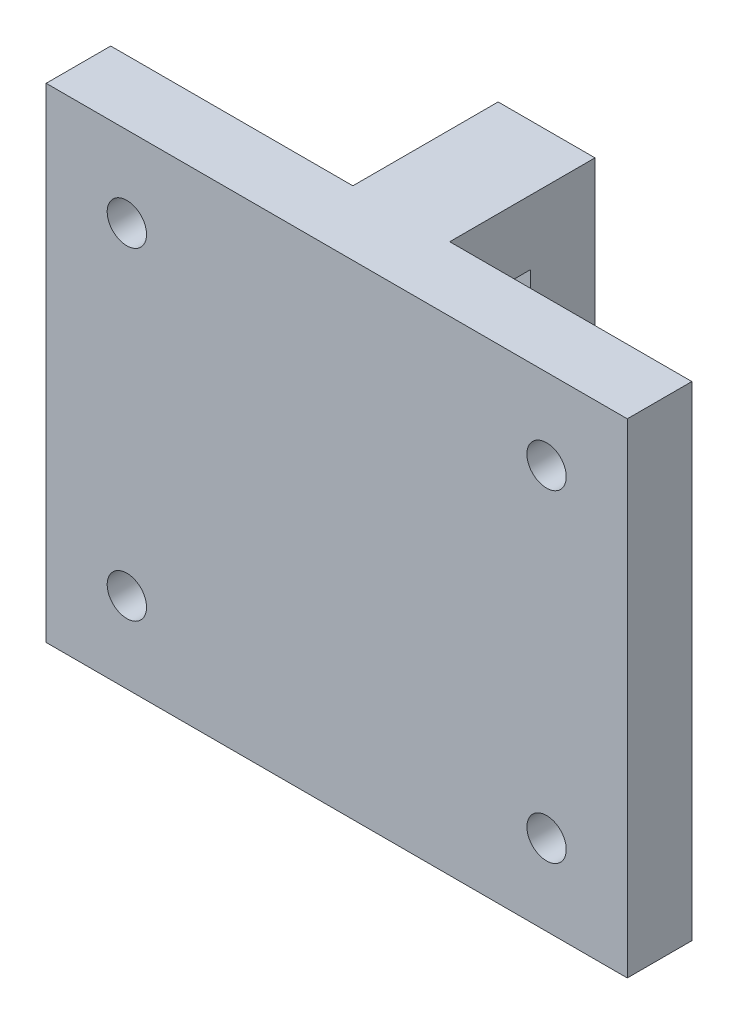
ISO-10303-21;
HEADER;
FILE_DESCRIPTION(('STEP AP214'),'2;1');
FILE_NAME('part.step','',(''),(''),'','','');
FILE_SCHEMA(('AUTOMOTIVE_DESIGN { 1 0 10303 214 1 1 1 1 }'));
ENDSEC;
DATA;
#1=APPLICATION_CONTEXT('core data for automotive mechanical design processes');
#2=APPLICATION_PROTOCOL_DEFINITION('international standard','automotive_design',2000,#1);
#3=PRODUCT_CONTEXT('',#1,'mechanical');
#4=PRODUCT('Part','Part','',(#3));
#5=PRODUCT_RELATED_PRODUCT_CATEGORY('part','',(#4));
#6=PRODUCT_DEFINITION_FORMATION('','',#4);
#7=PRODUCT_DEFINITION_CONTEXT('part definition',#1,'design');
#8=PRODUCT_DEFINITION('design','',#6,#7);
#9=PRODUCT_DEFINITION_SHAPE('','',#8);
#10=(LENGTH_UNIT() NAMED_UNIT(*) SI_UNIT(.MILLI.,.METRE.));
#11=(NAMED_UNIT(*) PLANE_ANGLE_UNIT() SI_UNIT($,.RADIAN.));
#12=(NAMED_UNIT(*) SI_UNIT($,.STERADIAN.) SOLID_ANGLE_UNIT());
#13=UNCERTAINTY_MEASURE_WITH_UNIT(LENGTH_MEASURE(1.E-05),#10,'distance_accuracy_value','');
#14=(GEOMETRIC_REPRESENTATION_CONTEXT(3) GLOBAL_UNCERTAINTY_ASSIGNED_CONTEXT((#13)) GLOBAL_UNIT_ASSIGNED_CONTEXT((#10,
#11,#12)) REPRESENTATION_CONTEXT('',''));
#15=CARTESIAN_POINT('',(0.,0.,0.));
#16=DIRECTION('',(0.,0.,1.));
#17=DIRECTION('',(1.,0.,0.));
#18=AXIS2_PLACEMENT_3D('',#15,#16,#17);
#19=CARTESIAN_POINT('',(3.,0.,0.));
#20=DIRECTION('',(1.,0.,0.));
#21=DIRECTION('',(0.,0.,-1.));
#22=AXIS2_PLACEMENT_3D('',#19,#20,#21);
#23=PLANE('',#22);
#24=DIRECTION('',(0.,0.,-1.));
#25=VECTOR('',#24,1.);
#26=CARTESIAN_POINT('',(3.,30.,0.));
#27=LINE('',#26,#25);
#28=CARTESIAN_POINT('',(3.,30.,-4.));
#29=VERTEX_POINT('',#28);
#30=CARTESIAN_POINT('',(3.,30.,-13.));
#31=VERTEX_POINT('',#30);
#32=EDGE_CURVE('E57',#29,#31,#27,.T.);
#33=ORIENTED_EDGE('',*,*,#32,.F.);
#34=DIRECTION('',(0.,-1.,0.));
#35=VECTOR('',#34,1.);
#36=CARTESIAN_POINT('',(3.,0.,-4.));
#37=LINE('',#36,#35);
#38=CARTESIAN_POINT('',(3.,26.,-4.));
#39=VERTEX_POINT('',#38);
#40=EDGE_CURVE('E164',#29,#39,#37,.T.);
#41=ORIENTED_EDGE('',*,*,#40,.T.);
#42=DIRECTION('',(0.,0.,-1.));
#43=VECTOR('',#42,1.);
#44=CARTESIAN_POINT('',(3.,26.,0.));
#45=LINE('',#44,#43);
#46=CARTESIAN_POINT('',(3.,26.,-9.));
#47=VERTEX_POINT('',#46);
#48=EDGE_CURVE('E171',#39,#47,#45,.T.);
#49=ORIENTED_EDGE('',*,*,#48,.T.);
#50=DIRECTION('',(0.,-1.,0.));
#51=VECTOR('',#50,1.);
#52=CARTESIAN_POINT('',(3.,0.,-9.00000000000001));
#53=LINE('',#52,#51);
#54=CARTESIAN_POINT('',(3.,16.,-9.00000000000001));
#55=VERTEX_POINT('',#54);
#56=EDGE_CURVE('E89',#47,#55,#53,.T.);
#57=ORIENTED_EDGE('',*,*,#56,.T.);
#58=DIRECTION('',(0.,0.,1.));
#59=VECTOR('',#58,1.);
#60=CARTESIAN_POINT('',(3.,16.,0.));
#61=LINE('',#60,#59);
#62=CARTESIAN_POINT('',(3.,16.,-13.));
#63=VERTEX_POINT('',#62);
#64=EDGE_CURVE('E175',#63,#55,#61,.T.);
#65=ORIENTED_EDGE('',*,*,#64,.F.);
#66=DIRECTION('',(0.,-1.,0.));
#67=VECTOR('',#66,1.);
#68=CARTESIAN_POINT('',(3.,0.,-13.));
#69=LINE('',#68,#67);
#70=EDGE_CURVE('E178',#31,#63,#69,.T.);
#71=ORIENTED_EDGE('',*,*,#70,.F.);
#72=EDGE_LOOP('',(#33,#41,#49,#57,#65,#71));
#73=FACE_BOUND('',#72,.T.);
#74=ADVANCED_FACE('F35',(#73),#23,.T.);
#75=CARTESIAN_POINT('',(-3.,0.,0.));
#76=DIRECTION('',(1.,0.,0.));
#77=DIRECTION('',(0.,0.,-1.));
#78=AXIS2_PLACEMENT_3D('',#75,#76,#77);
#79=PLANE('',#78);
#80=DIRECTION('',(0.,-1.,0.));
#81=VECTOR('',#80,1.);
#82=CARTESIAN_POINT('',(-3.,0.,-4.));
#83=LINE('',#82,#81);
#84=CARTESIAN_POINT('',(-3.,30.,-4.));
#85=VERTEX_POINT('',#84);
#86=CARTESIAN_POINT('',(-3.,26.,-4.));
#87=VERTEX_POINT('',#86);
#88=EDGE_CURVE('E11',#85,#87,#83,.T.);
#89=ORIENTED_EDGE('',*,*,#88,.F.);
#90=DIRECTION('',(0.,0.,-1.));
#91=VECTOR('',#90,1.);
#92=CARTESIAN_POINT('',(-3.,30.,0.));
#93=LINE('',#92,#91);
#94=CARTESIAN_POINT('',(-3.,30.,-13.));
#95=VERTEX_POINT('',#94);
#96=EDGE_CURVE('E173',#85,#95,#93,.T.);
#97=ORIENTED_EDGE('',*,*,#96,.T.);
#98=DIRECTION('',(0.,-1.,0.));
#99=VECTOR('',#98,1.);
#100=CARTESIAN_POINT('',(-3.,0.,-13.));
#101=LINE('',#100,#99);
#102=CARTESIAN_POINT('',(-3.,16.,-13.));
#103=VERTEX_POINT('',#102);
#104=EDGE_CURVE('E189',#95,#103,#101,.T.);
#105=ORIENTED_EDGE('',*,*,#104,.T.);
#106=DIRECTION('',(0.,0.,1.));
#107=VECTOR('',#106,1.);
#108=CARTESIAN_POINT('',(-3.,16.,0.));
#109=LINE('',#108,#107);
#110=CARTESIAN_POINT('',(-3.,16.,-9.00000000000001));
#111=VERTEX_POINT('',#110);
#112=EDGE_CURVE('E186',#103,#111,#109,.T.);
#113=ORIENTED_EDGE('',*,*,#112,.T.);
#114=DIRECTION('',(0.,-1.,0.));
#115=VECTOR('',#114,1.);
#116=CARTESIAN_POINT('',(-3.,0.,-9.00000000000001));
#117=LINE('',#116,#115);
#118=CARTESIAN_POINT('',(-3.,26.,-9.));
#119=VERTEX_POINT('',#118);
#120=EDGE_CURVE('E183',#119,#111,#117,.T.);
#121=ORIENTED_EDGE('',*,*,#120,.F.);
#122=DIRECTION('',(0.,0.,-1.));
#123=VECTOR('',#122,1.);
#124=CARTESIAN_POINT('',(-3.,26.,0.));
#125=LINE('',#124,#123);
#126=EDGE_CURVE('E170',#87,#119,#125,.T.);
#127=ORIENTED_EDGE('',*,*,#126,.F.);
#128=EDGE_LOOP('',(#89,#97,#105,#113,#121,#127));
#129=FACE_BOUND('',#128,.T.);
#130=ADVANCED_FACE('F204',(#129),#79,.F.);
#131=CARTESIAN_POINT('',(3.,26.,0.));
#132=DIRECTION('',(0.,1.,0.));
#133=DIRECTION('',(0.,0.,1.));
#134=AXIS2_PLACEMENT_3D('',#131,#132,#133);
#135=PLANE('',#134);
#136=ORIENTED_EDGE('',*,*,#126,.T.);
#137=DIRECTION('',(-1.,0.,0.));
#138=VECTOR('',#137,1.);
#139=CARTESIAN_POINT('',(3.,26.,-9.));
#140=LINE('',#139,#138);
#141=EDGE_CURVE('E43',#47,#119,#140,.T.);
#142=ORIENTED_EDGE('',*,*,#141,.F.);
#143=ORIENTED_EDGE('',*,*,#48,.F.);
#144=DIRECTION('',(-1.,0.,0.));
#145=VECTOR('',#144,1.);
#146=CARTESIAN_POINT('',(3.,26.,-4.));
#147=LINE('',#146,#145);
#148=EDGE_CURVE('E82',#39,#87,#147,.T.);
#149=ORIENTED_EDGE('',*,*,#148,.T.);
#150=EDGE_LOOP('',(#136,#142,#143,#149));
#151=FACE_BOUND('',#150,.T.);
#152=ADVANCED_FACE('F37',(#151),#135,.F.);
#153=CARTESIAN_POINT('',(3.,0.,-9.00000000000001));
#154=DIRECTION('',(0.,0.,-1.));
#155=DIRECTION('',(0.,1.,0.));
#156=AXIS2_PLACEMENT_3D('',#153,#154,#155);
#157=PLANE('',#156);
#158=ORIENTED_EDGE('',*,*,#120,.T.);
#159=DIRECTION('',(-1.,0.,0.));
#160=VECTOR('',#159,1.);
#161=CARTESIAN_POINT('',(3.,16.,-9.00000000000001));
#162=LINE('',#161,#160);
#163=EDGE_CURVE('E201',#55,#111,#162,.T.);
#164=ORIENTED_EDGE('',*,*,#163,.F.);
#165=ORIENTED_EDGE('',*,*,#56,.F.);
#166=ORIENTED_EDGE('',*,*,#141,.T.);
#167=EDGE_LOOP('',(#158,#164,#165,#166));
#168=FACE_BOUND('',#167,.T.);
#169=ADVANCED_FACE('F203',(#168),#157,.F.);
#170=CARTESIAN_POINT('',(3.,16.,0.));
#171=DIRECTION('',(0.,-1.,0.));
#172=DIRECTION('',(0.,0.,-1.));
#173=AXIS2_PLACEMENT_3D('',#170,#171,#172);
#174=PLANE('',#173);
#175=ORIENTED_EDGE('',*,*,#112,.F.);
#176=DIRECTION('',(-1.,0.,0.));
#177=VECTOR('',#176,1.);
#178=CARTESIAN_POINT('',(3.,16.,-13.));
#179=LINE('',#178,#177);
#180=EDGE_CURVE('E199',#63,#103,#179,.T.);
#181=ORIENTED_EDGE('',*,*,#180,.F.);
#182=ORIENTED_EDGE('',*,*,#64,.T.);
#183=ORIENTED_EDGE('',*,*,#163,.T.);
#184=EDGE_LOOP('',(#175,#181,#182,#183));
#185=FACE_BOUND('',#184,.T.);
#186=ADVANCED_FACE('F213',(#185),#174,.T.);
#187=CARTESIAN_POINT('',(3.,0.,-13.));
#188=DIRECTION('',(0.,0.,-1.));
#189=DIRECTION('',(0.,1.,0.));
#190=AXIS2_PLACEMENT_3D('',#187,#188,#189);
#191=PLANE('',#190);
#192=ORIENTED_EDGE('',*,*,#104,.F.);
#193=DIRECTION('',(-1.,0.,0.));
#194=VECTOR('',#193,1.);
#195=CARTESIAN_POINT('',(3.,30.,-13.));
#196=LINE('',#195,#194);
#197=EDGE_CURVE('E197',#31,#95,#196,.T.);
#198=ORIENTED_EDGE('',*,*,#197,.F.);
#199=ORIENTED_EDGE('',*,*,#70,.T.);
#200=ORIENTED_EDGE('',*,*,#180,.T.);
#201=EDGE_LOOP('',(#192,#198,#199,#200));
#202=FACE_BOUND('',#201,.T.);
#203=ADVANCED_FACE('F209',(#202),#191,.T.);
#204=CARTESIAN_POINT('',(3.,30.,0.));
#205=DIRECTION('',(0.,1.,0.));
#206=DIRECTION('',(0.,0.,1.));
#207=AXIS2_PLACEMENT_3D('',#204,#205,#206);
#208=PLANE('',#207);
#209=DIRECTION('',(-1.,0.,0.));
#210=VECTOR('',#209,1.);
#211=CARTESIAN_POINT('',(-18.,30.,-4.));
#212=LINE('',#211,#210);
#213=CARTESIAN_POINT('',(18.,30.,-4.));
#214=VERTEX_POINT('',#213);
#215=EDGE_CURVE('E144',#214,#29,#212,.T.);
#216=ORIENTED_EDGE('',*,*,#215,.T.);
#217=ORIENTED_EDGE('',*,*,#32,.T.);
#218=ORIENTED_EDGE('',*,*,#197,.T.);
#219=ORIENTED_EDGE('',*,*,#96,.F.);
#220=CARTESIAN_POINT('',(-18.,30.,-4.));
#221=VERTEX_POINT('',#220);
#222=EDGE_CURVE('E152',#85,#221,#212,.T.);
#223=ORIENTED_EDGE('',*,*,#222,.T.);
#224=DIRECTION('',(0.,0.,1.));
#225=VECTOR('',#224,1.);
#226=CARTESIAN_POINT('',(-18.,30.,-4.));
#227=LINE('',#226,#225);
#228=CARTESIAN_POINT('',(-18.,30.,0.));
#229=VERTEX_POINT('',#228);
#230=EDGE_CURVE('E149',#221,#229,#227,.T.);
#231=ORIENTED_EDGE('',*,*,#230,.T.);
#232=DIRECTION('',(-1.,0.,0.));
#233=VECTOR('',#232,1.);
#234=CARTESIAN_POINT('',(3.,30.,0.));
#235=LINE('',#234,#233);
#236=CARTESIAN_POINT('',(18.,30.,0.));
#237=VERTEX_POINT('',#236);
#238=EDGE_CURVE('E195',#237,#229,#235,.T.);
#239=ORIENTED_EDGE('',*,*,#238,.F.);
#240=DIRECTION('',(0.,0.,1.));
#241=VECTOR('',#240,1.);
#242=CARTESIAN_POINT('',(18.,30.,-4.));
#243=LINE('',#242,#241);
#244=EDGE_CURVE('E165',#214,#237,#243,.T.);
#245=ORIENTED_EDGE('',*,*,#244,.F.);
#246=EDGE_LOOP('',(#216,#217,#218,#219,#223,#231,#239,#245));
#247=FACE_BOUND('',#246,.T.);
#248=ADVANCED_FACE('F205',(#247),#208,.T.);
#249=CARTESIAN_POINT('',(3.,0.,0.));
#250=DIRECTION('',(0.,0.,1.));
#251=DIRECTION('',(1.,0.,0.));
#252=AXIS2_PLACEMENT_3D('',#249,#250,#251);
#253=PLANE('',#252);
#254=CARTESIAN_POINT('',(13.,25.,0.));
#255=DIRECTION('',(0.,0.,-1.));
#256=DIRECTION('',(0.,1.,0.));
#257=AXIS2_PLACEMENT_3D('',#254,#255,#256);
#258=CIRCLE('',#257,1.2192);
#259=CARTESIAN_POINT('',(13.,26.2192,0.));
#260=VERTEX_POINT('',#259);
#261=EDGE_CURVE('E279',#260,#260,#258,.T.);
#262=ORIENTED_EDGE('',*,*,#261,.T.);
#263=EDGE_LOOP('',(#262));
#264=FACE_BOUND('',#263,.T.);
#265=CARTESIAN_POINT('',(13.,5.,0.));
#266=DIRECTION('',(0.,0.,-1.));
#267=DIRECTION('',(0.,1.,0.));
#268=AXIS2_PLACEMENT_3D('',#265,#266,#267);
#269=CIRCLE('',#268,1.2192);
#270=CARTESIAN_POINT('',(13.,6.2192,0.));
#271=VERTEX_POINT('',#270);
#272=EDGE_CURVE('E272',#271,#271,#269,.T.);
#273=ORIENTED_EDGE('',*,*,#272,.T.);
#274=EDGE_LOOP('',(#273));
#275=FACE_BOUND('',#274,.T.);
#276=CARTESIAN_POINT('',(-13.,5.,0.));
#277=DIRECTION('',(0.,0.,-1.));
#278=DIRECTION('',(0.,1.,0.));
#279=AXIS2_PLACEMENT_3D('',#276,#277,#278);
#280=CIRCLE('',#279,1.2192);
#281=CARTESIAN_POINT('',(-13.,6.2192,0.));
#282=VERTEX_POINT('',#281);
#283=EDGE_CURVE('E262',#282,#282,#280,.T.);
#284=ORIENTED_EDGE('',*,*,#283,.T.);
#285=EDGE_LOOP('',(#284));
#286=FACE_BOUND('',#285,.T.);
#287=CARTESIAN_POINT('',(-13.,25.,0.));
#288=DIRECTION('',(0.,0.,-1.));
#289=DIRECTION('',(0.,1.,0.));
#290=AXIS2_PLACEMENT_3D('',#287,#288,#289);
#291=CIRCLE('',#290,1.2192);
#292=CARTESIAN_POINT('',(-13.,26.2192,0.));
#293=VERTEX_POINT('',#292);
#294=EDGE_CURVE('E158',#293,#293,#291,.T.);
#295=ORIENTED_EDGE('',*,*,#294,.T.);
#296=EDGE_LOOP('',(#295));
#297=FACE_BOUND('',#296,.T.);
#298=ORIENTED_EDGE('',*,*,#238,.T.);
#299=DIRECTION('',(0.,-1.,0.));
#300=VECTOR('',#299,1.);
#301=CARTESIAN_POINT('',(-18.,30.,0.));
#302=LINE('',#301,#300);
#303=CARTESIAN_POINT('',(-18.,0.,0.));
#304=VERTEX_POINT('',#303);
#305=EDGE_CURVE('E155',#229,#304,#302,.T.);
#306=ORIENTED_EDGE('',*,*,#305,.T.);
#307=DIRECTION('',(-1.,0.,0.));
#308=VECTOR('',#307,1.);
#309=CARTESIAN_POINT('',(3.,0.,0.));
#310=LINE('',#309,#308);
#311=CARTESIAN_POINT('',(18.,0.,0.));
#312=VERTEX_POINT('',#311);
#313=EDGE_CURVE('E135',#312,#304,#310,.T.);
#314=ORIENTED_EDGE('',*,*,#313,.F.);
#315=DIRECTION('',(0.,1.,0.));
#316=VECTOR('',#315,1.);
#317=CARTESIAN_POINT('',(18.,30.,0.));
#318=LINE('',#317,#316);
#319=EDGE_CURVE('E150',#312,#237,#318,.T.);
#320=ORIENTED_EDGE('',*,*,#319,.T.);
#321=EDGE_LOOP('',(#298,#306,#314,#320));
#322=FACE_BOUND('',#321,.T.);
#323=ADVANCED_FACE('F219',(#264,#275,#286,#297,#322),#253,.T.);
#324=CARTESIAN_POINT('',(3.,0.,0.));
#325=DIRECTION('',(0.,1.,0.));
#326=DIRECTION('',(0.,0.,1.));
#327=AXIS2_PLACEMENT_3D('',#324,#325,#326);
#328=PLANE('',#327);
#329=ORIENTED_EDGE('',*,*,#313,.T.);
#330=DIRECTION('',(0.,0.,1.));
#331=VECTOR('',#330,1.);
#332=CARTESIAN_POINT('',(-18.,0.,-4.));
#333=LINE('',#332,#331);
#334=CARTESIAN_POINT('',(-18.,0.,-4.));
#335=VERTEX_POINT('',#334);
#336=EDGE_CURVE('E138',#335,#304,#333,.T.);
#337=ORIENTED_EDGE('',*,*,#336,.F.);
#338=DIRECTION('',(-1.,0.,0.));
#339=VECTOR('',#338,1.);
#340=CARTESIAN_POINT('',(3.,0.,-4.));
#341=LINE('',#340,#339);
#342=CARTESIAN_POINT('',(18.,0.,-4.));
#343=VERTEX_POINT('',#342);
#344=EDGE_CURVE('E123',#343,#335,#341,.T.);
#345=ORIENTED_EDGE('',*,*,#344,.F.);
#346=DIRECTION('',(0.,0.,1.));
#347=VECTOR('',#346,1.);
#348=CARTESIAN_POINT('',(18.,0.,-4.));
#349=LINE('',#348,#347);
#350=EDGE_CURVE('E143',#343,#312,#349,.T.);
#351=ORIENTED_EDGE('',*,*,#350,.T.);
#352=EDGE_LOOP('',(#329,#337,#345,#351));
#353=FACE_BOUND('',#352,.T.);
#354=ADVANCED_FACE('F139',(#353),#328,.F.);
#355=CARTESIAN_POINT('',(3.,0.,-4.));
#356=DIRECTION('',(0.,0.,1.));
#357=DIRECTION('',(1.,0.,0.));
#358=AXIS2_PLACEMENT_3D('',#355,#356,#357);
#359=PLANE('',#358);
#360=CARTESIAN_POINT('',(13.,25.,-4.));
#361=DIRECTION('',(0.,0.,-1.));
#362=DIRECTION('',(0.,1.,0.));
#363=AXIS2_PLACEMENT_3D('',#360,#361,#362);
#364=CIRCLE('',#363,2.1844);
#365=CARTESIAN_POINT('',(13.,27.1844,-4.));
#366=VERTEX_POINT('',#365);
#367=EDGE_CURVE('E248',#366,#366,#364,.T.);
#368=ORIENTED_EDGE('',*,*,#367,.F.);
#369=EDGE_LOOP('',(#368));
#370=FACE_BOUND('',#369,.T.);
#371=CARTESIAN_POINT('',(13.,5.,-4.));
#372=DIRECTION('',(0.,0.,-1.));
#373=DIRECTION('',(0.,1.,0.));
#374=AXIS2_PLACEMENT_3D('',#371,#372,#373);
#375=CIRCLE('',#374,2.1844);
#376=CARTESIAN_POINT('',(13.,7.1844,-4.));
#377=VERTEX_POINT('',#376);
#378=EDGE_CURVE('E252',#377,#377,#375,.T.);
#379=ORIENTED_EDGE('',*,*,#378,.F.);
#380=EDGE_LOOP('',(#379));
#381=FACE_BOUND('',#380,.T.);
#382=CARTESIAN_POINT('',(-13.,5.,-4.));
#383=DIRECTION('',(0.,0.,-1.));
#384=DIRECTION('',(0.,1.,0.));
#385=AXIS2_PLACEMENT_3D('',#382,#383,#384);
#386=CIRCLE('',#385,2.1844);
#387=CARTESIAN_POINT('',(-13.,7.1844,-4.));
#388=VERTEX_POINT('',#387);
#389=EDGE_CURVE('E256',#388,#388,#386,.T.);
#390=ORIENTED_EDGE('',*,*,#389,.F.);
#391=EDGE_LOOP('',(#390));
#392=FACE_BOUND('',#391,.T.);
#393=CARTESIAN_POINT('',(-13.,25.,-4.));
#394=DIRECTION('',(0.,0.,-1.));
#395=DIRECTION('',(0.,1.,0.));
#396=AXIS2_PLACEMENT_3D('',#393,#394,#395);
#397=CIRCLE('',#396,2.1844);
#398=CARTESIAN_POINT('',(-13.,27.1844,-4.));
#399=VERTEX_POINT('',#398);
#400=EDGE_CURVE('E259',#399,#399,#397,.T.);
#401=ORIENTED_EDGE('',*,*,#400,.F.);
#402=EDGE_LOOP('',(#401));
#403=FACE_BOUND('',#402,.T.);
#404=ORIENTED_EDGE('',*,*,#344,.T.);
#405=DIRECTION('',(0.,-1.,0.));
#406=VECTOR('',#405,1.);
#407=CARTESIAN_POINT('',(-18.,30.,-4.));
#408=LINE('',#407,#406);
#409=EDGE_CURVE('E128',#221,#335,#408,.T.);
#410=ORIENTED_EDGE('',*,*,#409,.F.);
#411=ORIENTED_EDGE('',*,*,#222,.F.);
#412=ORIENTED_EDGE('',*,*,#88,.T.);
#413=ORIENTED_EDGE('',*,*,#148,.F.);
#414=ORIENTED_EDGE('',*,*,#40,.F.);
#415=ORIENTED_EDGE('',*,*,#215,.F.);
#416=DIRECTION('',(0.,1.,0.));
#417=VECTOR('',#416,1.);
#418=CARTESIAN_POINT('',(18.,30.,-4.));
#419=LINE('',#418,#417);
#420=EDGE_CURVE('E131',#343,#214,#419,.T.);
#421=ORIENTED_EDGE('',*,*,#420,.F.);
#422=EDGE_LOOP('',(#404,#410,#411,#412,#413,#414,#415,#421));
#423=FACE_BOUND('',#422,.T.);
#424=ADVANCED_FACE('F125',(#370,#381,#392,#403,#423),#359,.F.);
#425=CARTESIAN_POINT('',(-18.,30.,-4.));
#426=DIRECTION('',(-1.,0.,0.));
#427=DIRECTION('',(0.,-1.,0.));
#428=AXIS2_PLACEMENT_3D('',#425,#426,#427);
#429=PLANE('',#428);
#430=ORIENTED_EDGE('',*,*,#305,.F.);
#431=ORIENTED_EDGE('',*,*,#230,.F.);
#432=ORIENTED_EDGE('',*,*,#409,.T.);
#433=ORIENTED_EDGE('',*,*,#336,.T.);
#434=EDGE_LOOP('',(#430,#431,#432,#433));
#435=FACE_BOUND('',#434,.T.);
#436=ADVANCED_FACE('F147',(#435),#429,.T.);
#437=CARTESIAN_POINT('',(18.,30.,-4.));
#438=DIRECTION('',(1.,0.,0.));
#439=DIRECTION('',(0.,1.,0.));
#440=AXIS2_PLACEMENT_3D('',#437,#438,#439);
#441=PLANE('',#440);
#442=ORIENTED_EDGE('',*,*,#319,.F.);
#443=ORIENTED_EDGE('',*,*,#350,.F.);
#444=ORIENTED_EDGE('',*,*,#420,.T.);
#445=ORIENTED_EDGE('',*,*,#244,.T.);
#446=EDGE_LOOP('',(#442,#443,#444,#445));
#447=FACE_BOUND('',#446,.T.);
#448=ADVANCED_FACE('F217',(#447),#441,.T.);
#449=CARTESIAN_POINT('',(-13.,25.,-4.));
#450=DIRECTION('',(0.,0.,-1.));
#451=DIRECTION('',(0.,1.,0.));
#452=AXIS2_PLACEMENT_3D('',#449,#450,#451);
#453=CYLINDRICAL_SURFACE('',#452,1.2192);
#454=ORIENTED_EDGE('',*,*,#294,.F.);
#455=EDGE_LOOP('',(#454));
#456=FACE_BOUND('',#455,.T.);
#457=CARTESIAN_POINT('',(-13.,25.,-3.19010103598769));
#458=DIRECTION('',(0.,0.,-1.));
#459=DIRECTION('',(0.,1.,0.));
#460=AXIS2_PLACEMENT_3D('',#457,#458,#459);
#461=CIRCLE('',#460,1.2192);
#462=CARTESIAN_POINT('',(-13.,26.2192,-3.19010103598769));
#463=VERTEX_POINT('',#462);
#464=EDGE_CURVE('E261',#463,#463,#461,.T.);
#465=ORIENTED_EDGE('',*,*,#464,.T.);
#466=EDGE_LOOP('',(#465));
#467=FACE_BOUND('',#466,.T.);
#468=ADVANCED_FACE('F316',(#456,#467),#453,.F.);
#469=CARTESIAN_POINT('',(-13.,25.,-4.));
#470=DIRECTION('',(0.,0.,-1.));
#471=DIRECTION('',(0.,1.,0.));
#472=AXIS2_PLACEMENT_3D('',#469,#470,#471);
#473=CONICAL_SURFACE('',#472,2.1844,0.872664625997164);
#474=ORIENTED_EDGE('',*,*,#464,.F.);
#475=EDGE_LOOP('',(#474));
#476=FACE_BOUND('',#475,.T.);
#477=ORIENTED_EDGE('',*,*,#400,.T.);
#478=EDGE_LOOP('',(#477));
#479=FACE_BOUND('',#478,.T.);
#480=ADVANCED_FACE('F312',(#476,#479),#473,.F.);
#481=CARTESIAN_POINT('',(-13.,5.,-4.));
#482=DIRECTION('',(0.,0.,-1.));
#483=DIRECTION('',(0.,1.,0.));
#484=AXIS2_PLACEMENT_3D('',#481,#482,#483);
#485=CYLINDRICAL_SURFACE('',#484,1.2192);
#486=ORIENTED_EDGE('',*,*,#283,.F.);
#487=EDGE_LOOP('',(#486));
#488=FACE_BOUND('',#487,.T.);
#489=CARTESIAN_POINT('',(-13.,5.,-3.19010103598769));
#490=DIRECTION('',(0.,0.,-1.));
#491=DIRECTION('',(0.,1.,0.));
#492=AXIS2_PLACEMENT_3D('',#489,#490,#491);
#493=CIRCLE('',#492,1.2192);
#494=CARTESIAN_POINT('',(-13.,6.2192,-3.19010103598769));
#495=VERTEX_POINT('',#494);
#496=EDGE_CURVE('E266',#495,#495,#493,.T.);
#497=ORIENTED_EDGE('',*,*,#496,.T.);
#498=EDGE_LOOP('',(#497));
#499=FACE_BOUND('',#498,.T.);
#500=ADVANCED_FACE('F308',(#488,#499),#485,.F.);
#501=CARTESIAN_POINT('',(-13.,5.,-4.));
#502=DIRECTION('',(0.,0.,-1.));
#503=DIRECTION('',(0.,1.,0.));
#504=AXIS2_PLACEMENT_3D('',#501,#502,#503);
#505=CONICAL_SURFACE('',#504,2.1844,0.872664625997164);
#506=ORIENTED_EDGE('',*,*,#496,.F.);
#507=EDGE_LOOP('',(#506));
#508=FACE_BOUND('',#507,.T.);
#509=ORIENTED_EDGE('',*,*,#389,.T.);
#510=EDGE_LOOP('',(#509));
#511=FACE_BOUND('',#510,.T.);
#512=ADVANCED_FACE('F304',(#508,#511),#505,.F.);
#513=CARTESIAN_POINT('',(13.,5.,-4.));
#514=DIRECTION('',(0.,0.,-1.));
#515=DIRECTION('',(0.,1.,0.));
#516=AXIS2_PLACEMENT_3D('',#513,#514,#515);
#517=CYLINDRICAL_SURFACE('',#516,1.2192);
#518=ORIENTED_EDGE('',*,*,#272,.F.);
#519=EDGE_LOOP('',(#518));
#520=FACE_BOUND('',#519,.T.);
#521=CARTESIAN_POINT('',(13.,5.,-3.19010103598769));
#522=DIRECTION('',(0.,0.,-1.));
#523=DIRECTION('',(0.,1.,0.));
#524=AXIS2_PLACEMENT_3D('',#521,#522,#523);
#525=CIRCLE('',#524,1.2192);
#526=CARTESIAN_POINT('',(13.,6.2192,-3.19010103598769));
#527=VERTEX_POINT('',#526);
#528=EDGE_CURVE('E275',#527,#527,#525,.T.);
#529=ORIENTED_EDGE('',*,*,#528,.T.);
#530=EDGE_LOOP('',(#529));
#531=FACE_BOUND('',#530,.T.);
#532=ADVANCED_FACE('F300',(#520,#531),#517,.F.);
#533=CARTESIAN_POINT('',(13.,5.,-4.));
#534=DIRECTION('',(0.,0.,-1.));
#535=DIRECTION('',(0.,1.,0.));
#536=AXIS2_PLACEMENT_3D('',#533,#534,#535);
#537=CONICAL_SURFACE('',#536,2.1844,0.872664625997164);
#538=ORIENTED_EDGE('',*,*,#528,.F.);
#539=EDGE_LOOP('',(#538));
#540=FACE_BOUND('',#539,.T.);
#541=ORIENTED_EDGE('',*,*,#378,.T.);
#542=EDGE_LOOP('',(#541));
#543=FACE_BOUND('',#542,.T.);
#544=ADVANCED_FACE('F293',(#540,#543),#537,.F.);
#545=CARTESIAN_POINT('',(13.,25.,-4.));
#546=DIRECTION('',(0.,0.,-1.));
#547=DIRECTION('',(0.,1.,0.));
#548=AXIS2_PLACEMENT_3D('',#545,#546,#547);
#549=CYLINDRICAL_SURFACE('',#548,1.2192);
#550=ORIENTED_EDGE('',*,*,#261,.F.);
#551=EDGE_LOOP('',(#550));
#552=FACE_BOUND('',#551,.T.);
#553=CARTESIAN_POINT('',(13.,25.,-3.19010103598769));
#554=DIRECTION('',(0.,0.,-1.));
#555=DIRECTION('',(0.,1.,0.));
#556=AXIS2_PLACEMENT_3D('',#553,#554,#555);
#557=CIRCLE('',#556,1.2192);
#558=CARTESIAN_POINT('',(13.,26.2192,-3.19010103598769));
#559=VERTEX_POINT('',#558);
#560=EDGE_CURVE('E281',#559,#559,#557,.T.);
#561=ORIENTED_EDGE('',*,*,#560,.T.);
#562=EDGE_LOOP('',(#561));
#563=FACE_BOUND('',#562,.T.);
#564=ADVANCED_FACE('F287',(#552,#563),#549,.F.);
#565=CARTESIAN_POINT('',(13.,25.,-4.));
#566=DIRECTION('',(0.,0.,-1.));
#567=DIRECTION('',(0.,1.,0.));
#568=AXIS2_PLACEMENT_3D('',#565,#566,#567);
#569=CONICAL_SURFACE('',#568,2.1844,0.872664625997164);
#570=ORIENTED_EDGE('',*,*,#560,.F.);
#571=EDGE_LOOP('',(#570));
#572=FACE_BOUND('',#571,.T.);
#573=ORIENTED_EDGE('',*,*,#367,.T.);
#574=EDGE_LOOP('',(#573));
#575=FACE_BOUND('',#574,.T.);
#576=ADVANCED_FACE('F285',(#572,#575),#569,.F.);
#577=CLOSED_SHELL('',(#74,#130,#152,#169,#186,#203,#248,#323,#354,#424,#436,#448,#468,#480,#500,
#512,#532,#544,#564,#576));
#578=MANIFOLD_SOLID_BREP('B2',#577);
#579=ADVANCED_BREP_SHAPE_REPRESENTATION('',(#18,#578),#14);
#580=SHAPE_DEFINITION_REPRESENTATION(#9,#579);
ENDSEC;
END-ISO-10303-21;
